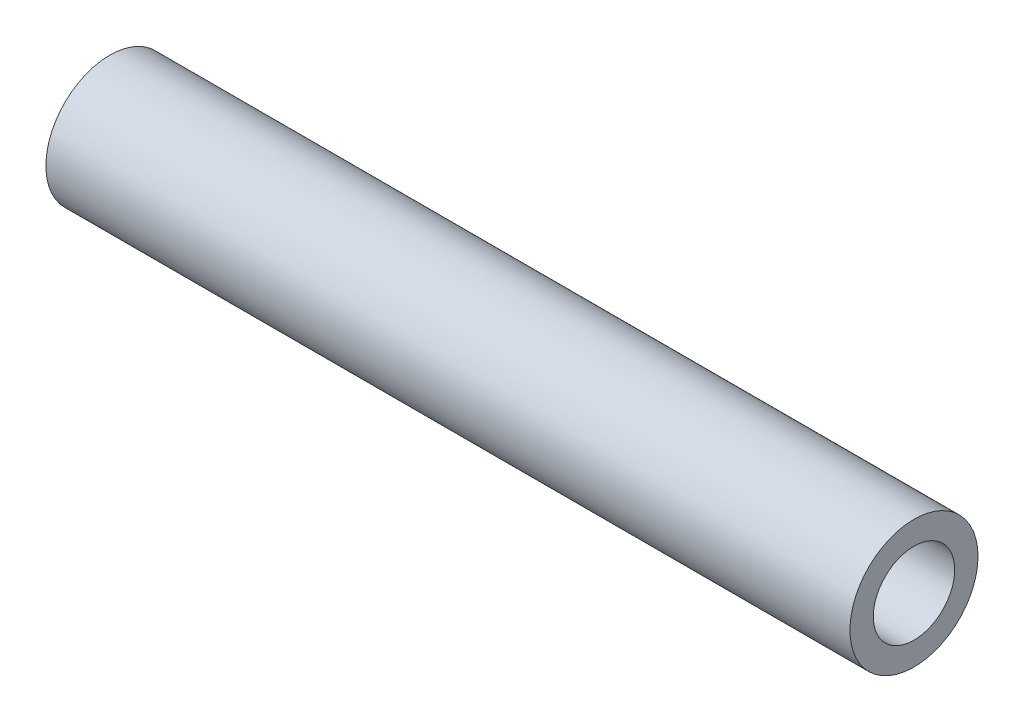
ISO-10303-21;
HEADER;
FILE_DESCRIPTION(('STEP AP214'),'2;1');
FILE_NAME('part.step','',(''),(''),'','','');
FILE_SCHEMA(('AUTOMOTIVE_DESIGN { 1 0 10303 214 1 1 1 1 }'));
ENDSEC;
DATA;
#1=APPLICATION_CONTEXT('core data for automotive mechanical design processes');
#2=APPLICATION_PROTOCOL_DEFINITION('international standard','automotive_design',2000,#1);
#3=PRODUCT_CONTEXT('',#1,'mechanical');
#4=PRODUCT('Part','Part','',(#3));
#5=PRODUCT_RELATED_PRODUCT_CATEGORY('part','',(#4));
#6=PRODUCT_DEFINITION_FORMATION('','',#4);
#7=PRODUCT_DEFINITION_CONTEXT('part definition',#1,'design');
#8=PRODUCT_DEFINITION('design','',#6,#7);
#9=PRODUCT_DEFINITION_SHAPE('','',#8);
#10=(LENGTH_UNIT() NAMED_UNIT(*) SI_UNIT(.MILLI.,.METRE.));
#11=(NAMED_UNIT(*) PLANE_ANGLE_UNIT() SI_UNIT($,.RADIAN.));
#12=(NAMED_UNIT(*) SI_UNIT($,.STERADIAN.) SOLID_ANGLE_UNIT());
#13=UNCERTAINTY_MEASURE_WITH_UNIT(LENGTH_MEASURE(1.E-05),#10,'distance_accuracy_value','');
#14=(GEOMETRIC_REPRESENTATION_CONTEXT(3) GLOBAL_UNCERTAINTY_ASSIGNED_CONTEXT((#13)) GLOBAL_UNIT_ASSIGNED_CONTEXT((#10,
#11,#12)) REPRESENTATION_CONTEXT('',''));
#15=CARTESIAN_POINT('',(0.,0.,0.));
#16=DIRECTION('',(0.,0.,1.));
#17=DIRECTION('',(1.,0.,0.));
#18=AXIS2_PLACEMENT_3D('',#15,#16,#17);
#19=CARTESIAN_POINT('',(19.939,0.,0.));
#20=DIRECTION('',(1.,0.,0.));
#21=DIRECTION('',(0.,0.,-1.));
#22=AXIS2_PLACEMENT_3D('',#19,#20,#21);
#23=PLANE('',#22);
#24=CARTESIAN_POINT('',(19.939,0.,0.));
#25=DIRECTION('',(1.,0.,0.));
#26=DIRECTION('',(0.,0.,-1.));
#27=AXIS2_PLACEMENT_3D('',#24,#25,#26);
#28=CIRCLE('',#27,2.0193);
#29=CARTESIAN_POINT('',(19.939,0.,-2.0193));
#30=VERTEX_POINT('',#29);
#31=EDGE_CURVE('E62',#30,#30,#28,.T.);
#32=ORIENTED_EDGE('',*,*,#31,.F.);
#33=EDGE_LOOP('',(#32));
#34=FACE_BOUND('',#33,.T.);
#35=CARTESIAN_POINT('',(19.939,0.,0.));
#36=DIRECTION('',(1.,0.,0.));
#37=DIRECTION('',(0.,0.,-1.));
#38=AXIS2_PLACEMENT_3D('',#35,#36,#37);
#39=CIRCLE('',#38,3.175);
#40=CARTESIAN_POINT('',(19.939,0.,-3.175));
#41=VERTEX_POINT('',#40);
#42=EDGE_CURVE('E10',#41,#41,#39,.T.);
#43=ORIENTED_EDGE('',*,*,#42,.T.);
#44=EDGE_LOOP('',(#43));
#45=FACE_BOUND('',#44,.T.);
#46=ADVANCED_FACE('F47',(#34,#45),#23,.T.);
#47=CARTESIAN_POINT('',(-19.939,0.,0.));
#48=DIRECTION('',(1.,0.,0.));
#49=DIRECTION('',(0.,0.,-1.));
#50=AXIS2_PLACEMENT_3D('',#47,#48,#49);
#51=PLANE('',#50);
#52=CARTESIAN_POINT('',(-19.939,0.,0.));
#53=DIRECTION('',(1.,0.,0.));
#54=DIRECTION('',(0.,0.,-1.));
#55=AXIS2_PLACEMENT_3D('',#52,#53,#54);
#56=CIRCLE('',#55,2.01929999999999);
#57=CARTESIAN_POINT('',(-19.939,0.,-2.01929999999999));
#58=VERTEX_POINT('',#57);
#59=EDGE_CURVE('E58',#58,#58,#56,.T.);
#60=ORIENTED_EDGE('',*,*,#59,.T.);
#61=EDGE_LOOP('',(#60));
#62=FACE_BOUND('',#61,.T.);
#63=CARTESIAN_POINT('',(-19.939,0.,0.));
#64=DIRECTION('',(1.,0.,0.));
#65=DIRECTION('',(0.,0.,-1.));
#66=AXIS2_PLACEMENT_3D('',#63,#64,#65);
#67=CIRCLE('',#66,3.175);
#68=CARTESIAN_POINT('',(-19.939,0.,-3.175));
#69=VERTEX_POINT('',#68);
#70=EDGE_CURVE('E51',#69,#69,#67,.T.);
#71=ORIENTED_EDGE('',*,*,#70,.F.);
#72=EDGE_LOOP('',(#71));
#73=FACE_BOUND('',#72,.T.);
#74=ADVANCED_FACE('F69',(#62,#73),#51,.F.);
#75=CARTESIAN_POINT('',(19.939,0.,0.));
#76=DIRECTION('',(-1.,0.,0.));
#77=DIRECTION('',(0.,0.,1.));
#78=AXIS2_PLACEMENT_3D('',#75,#76,#77);
#79=CYLINDRICAL_SURFACE('',#78,3.175);
#80=ORIENTED_EDGE('',*,*,#42,.F.);
#81=EDGE_LOOP('',(#80));
#82=FACE_BOUND('',#81,.T.);
#83=ORIENTED_EDGE('',*,*,#70,.T.);
#84=EDGE_LOOP('',(#83));
#85=FACE_BOUND('',#84,.T.);
#86=ADVANCED_FACE('F49',(#82,#85),#79,.T.);
#87=CARTESIAN_POINT('',(19.939,0.,0.));
#88=DIRECTION('',(1.,0.,0.));
#89=DIRECTION('',(0.,0.,-1.));
#90=AXIS2_PLACEMENT_3D('',#87,#88,#89);
#91=CYLINDRICAL_SURFACE('',#90,2.0193);
#92=ORIENTED_EDGE('',*,*,#59,.F.);
#93=EDGE_LOOP('',(#92));
#94=FACE_BOUND('',#93,.T.);
#95=ORIENTED_EDGE('',*,*,#31,.T.);
#96=EDGE_LOOP('',(#95));
#97=FACE_BOUND('',#96,.T.);
#98=ADVANCED_FACE('F66',(#94,#97),#91,.F.);
#99=CLOSED_SHELL('',(#46,#74,#86,#98));
#100=MANIFOLD_SOLID_BREP('B2',#99);
#101=ADVANCED_BREP_SHAPE_REPRESENTATION('',(#18,#100),#14);
#102=SHAPE_DEFINITION_REPRESENTATION(#9,#101);
ENDSEC;
END-ISO-10303-21;
